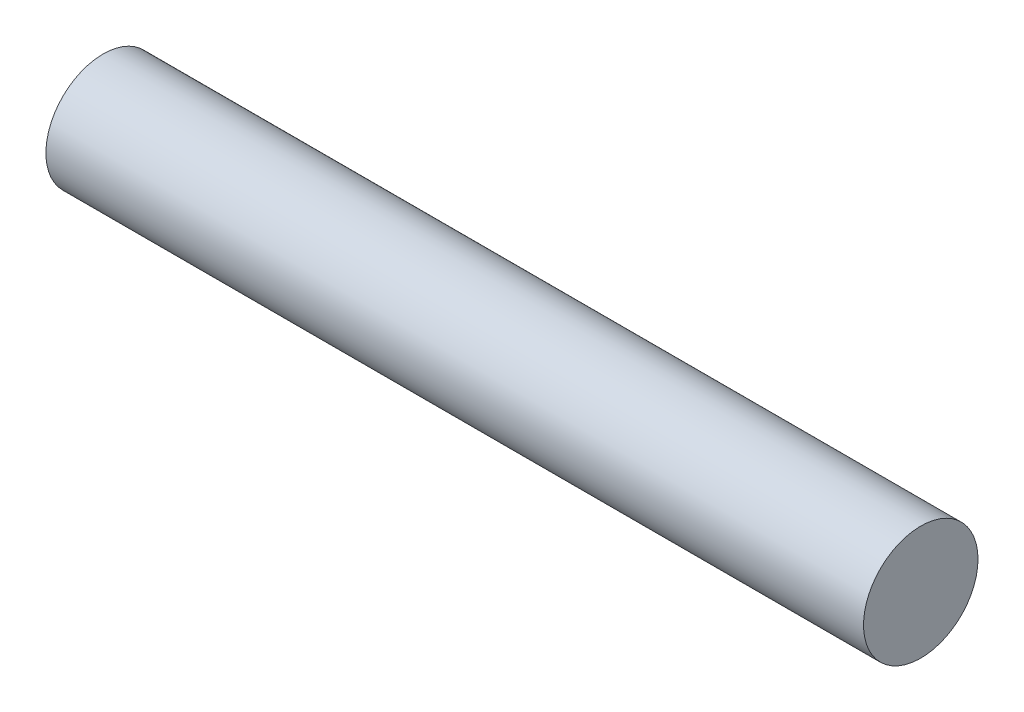
ISO-10303-21;
HEADER;
FILE_DESCRIPTION(('STEP AP214'),'2;1');
FILE_NAME('part.step','',(''),(''),'','','');
FILE_SCHEMA(('AUTOMOTIVE_DESIGN { 1 0 10303 214 1 1 1 1 }'));
ENDSEC;
DATA;
#1=APPLICATION_CONTEXT('core data for automotive mechanical design processes');
#2=APPLICATION_PROTOCOL_DEFINITION('international standard','automotive_design',2000,#1);
#3=PRODUCT_CONTEXT('',#1,'mechanical');
#4=PRODUCT('Part','Part','',(#3));
#5=PRODUCT_RELATED_PRODUCT_CATEGORY('part','',(#4));
#6=PRODUCT_DEFINITION_FORMATION('','',#4);
#7=PRODUCT_DEFINITION_CONTEXT('part definition',#1,'design');
#8=PRODUCT_DEFINITION('design','',#6,#7);
#9=PRODUCT_DEFINITION_SHAPE('','',#8);
#10=(LENGTH_UNIT() NAMED_UNIT(*) SI_UNIT(.MILLI.,.METRE.));
#11=(NAMED_UNIT(*) PLANE_ANGLE_UNIT() SI_UNIT($,.RADIAN.));
#12=(NAMED_UNIT(*) SI_UNIT($,.STERADIAN.) SOLID_ANGLE_UNIT());
#13=UNCERTAINTY_MEASURE_WITH_UNIT(LENGTH_MEASURE(1.E-05),#10,'distance_accuracy_value','');
#14=(GEOMETRIC_REPRESENTATION_CONTEXT(3) GLOBAL_UNCERTAINTY_ASSIGNED_CONTEXT((#13)) GLOBAL_UNIT_ASSIGNED_CONTEXT((#10,
#11,#12)) REPRESENTATION_CONTEXT('',''));
#15=CARTESIAN_POINT('',(0.,0.,0.));
#16=DIRECTION('',(0.,0.,1.));
#17=DIRECTION('',(1.,0.,0.));
#18=AXIS2_PLACEMENT_3D('',#15,#16,#17);
#19=CARTESIAN_POINT('',(79.375,0.,0.));
#20=DIRECTION('',(-1.,0.,0.));
#21=DIRECTION('',(0.,0.,1.));
#22=AXIS2_PLACEMENT_3D('',#19,#20,#21);
#23=CYLINDRICAL_SURFACE('',#22,11.1125);
#24=CARTESIAN_POINT('',(79.375,0.,0.));
#25=DIRECTION('',(1.,0.,0.));
#26=DIRECTION('',(0.,0.,-1.));
#27=AXIS2_PLACEMENT_3D('',#24,#25,#26);
#28=CIRCLE('',#27,11.1125);
#29=CARTESIAN_POINT('',(79.375,0.,-11.1125));
#30=VERTEX_POINT('',#29);
#31=EDGE_CURVE('E10',#30,#30,#28,.T.);
#32=ORIENTED_EDGE('',*,*,#31,.F.);
#33=EDGE_LOOP('',(#32));
#34=FACE_BOUND('',#33,.T.);
#35=CARTESIAN_POINT('',(-79.375,0.,0.));
#36=DIRECTION('',(1.,0.,0.));
#37=DIRECTION('',(0.,0.,-1.));
#38=AXIS2_PLACEMENT_3D('',#35,#36,#37);
#39=CIRCLE('',#38,11.1125);
#40=CARTESIAN_POINT('',(-79.375,0.,-11.1125));
#41=VERTEX_POINT('',#40);
#42=EDGE_CURVE('E33',#41,#41,#39,.T.);
#43=ORIENTED_EDGE('',*,*,#42,.T.);
#44=EDGE_LOOP('',(#43));
#45=FACE_BOUND('',#44,.T.);
#46=ADVANCED_FACE('F30',(#34,#45),#23,.T.);
#47=CARTESIAN_POINT('',(79.375,0.,0.));
#48=DIRECTION('',(1.,0.,0.));
#49=DIRECTION('',(0.,0.,-1.));
#50=AXIS2_PLACEMENT_3D('',#47,#48,#49);
#51=PLANE('',#50);
#52=ORIENTED_EDGE('',*,*,#31,.T.);
#53=EDGE_LOOP('',(#52));
#54=FACE_BOUND('',#53,.T.);
#55=ADVANCED_FACE('F45',(#54),#51,.T.);
#56=CARTESIAN_POINT('',(-79.375,0.,0.));
#57=DIRECTION('',(1.,0.,0.));
#58=DIRECTION('',(0.,0.,-1.));
#59=AXIS2_PLACEMENT_3D('',#56,#57,#58);
#60=PLANE('',#59);
#61=ORIENTED_EDGE('',*,*,#42,.F.);
#62=EDGE_LOOP('',(#61));
#63=FACE_BOUND('',#62,.T.);
#64=ADVANCED_FACE('F43',(#63),#60,.F.);
#65=CLOSED_SHELL('',(#46,#55,#64));
#66=MANIFOLD_SOLID_BREP('B2',#65);
#67=ADVANCED_BREP_SHAPE_REPRESENTATION('',(#18,#66),#14);
#68=SHAPE_DEFINITION_REPRESENTATION(#9,#67);
ENDSEC;
END-ISO-10303-21;
